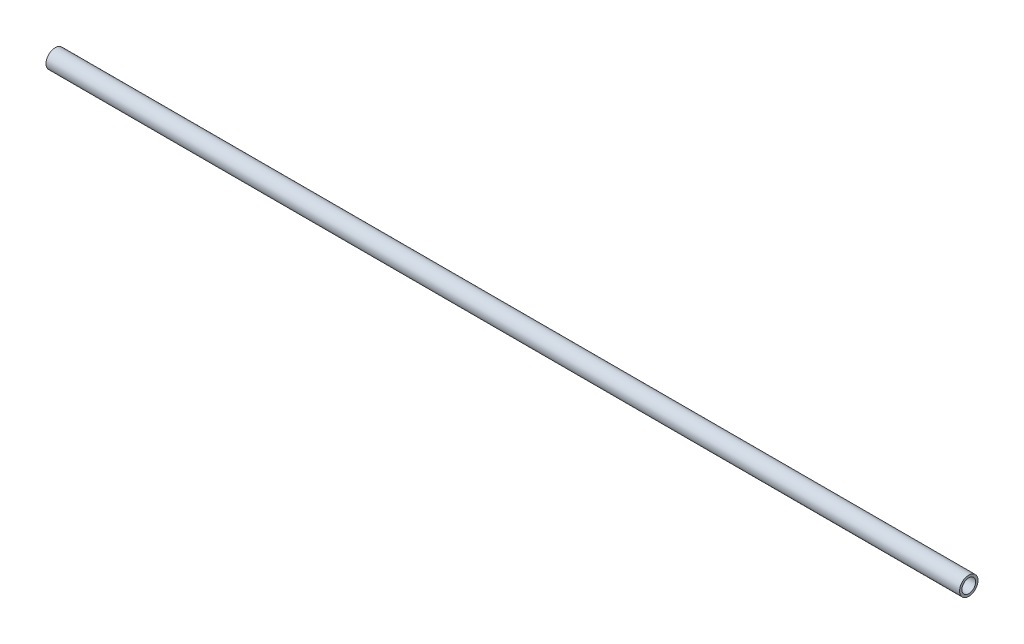
ISO-10303-21;
HEADER;
FILE_DESCRIPTION(('STEP AP214'),'2;1');
FILE_NAME('part.step','',(''),(''),'','','');
FILE_SCHEMA(('AUTOMOTIVE_DESIGN { 1 0 10303 214 1 1 1 1 }'));
ENDSEC;
DATA;
#1=APPLICATION_CONTEXT('core data for automotive mechanical design processes');
#2=APPLICATION_PROTOCOL_DEFINITION('international standard','automotive_design',2000,#1);
#3=PRODUCT_CONTEXT('',#1,'mechanical');
#4=PRODUCT('Part','Part','',(#3));
#5=PRODUCT_RELATED_PRODUCT_CATEGORY('part','',(#4));
#6=PRODUCT_DEFINITION_FORMATION('','',#4);
#7=PRODUCT_DEFINITION_CONTEXT('part definition',#1,'design');
#8=PRODUCT_DEFINITION('design','',#6,#7);
#9=PRODUCT_DEFINITION_SHAPE('','',#8);
#10=(LENGTH_UNIT() NAMED_UNIT(*) SI_UNIT(.MILLI.,.METRE.));
#11=(NAMED_UNIT(*) PLANE_ANGLE_UNIT() SI_UNIT($,.RADIAN.));
#12=(NAMED_UNIT(*) SI_UNIT($,.STERADIAN.) SOLID_ANGLE_UNIT());
#13=UNCERTAINTY_MEASURE_WITH_UNIT(LENGTH_MEASURE(1.E-05),#10,'distance_accuracy_value','');
#14=(GEOMETRIC_REPRESENTATION_CONTEXT(3) GLOBAL_UNCERTAINTY_ASSIGNED_CONTEXT((#13)) GLOBAL_UNIT_ASSIGNED_CONTEXT((#10,
#11,#12)) REPRESENTATION_CONTEXT('',''));
#15=CARTESIAN_POINT('',(0.,0.,0.));
#16=DIRECTION('',(0.,0.,1.));
#17=DIRECTION('',(1.,0.,0.));
#18=AXIS2_PLACEMENT_3D('',#15,#16,#17);
#19=CARTESIAN_POINT('',(635.,0.,0.));
#20=DIRECTION('',(1.,0.,0.));
#21=DIRECTION('',(0.,0.,-1.));
#22=AXIS2_PLACEMENT_3D('',#19,#20,#21);
#23=PLANE('',#22);
#24=CARTESIAN_POINT('',(635.,0.,0.));
#25=DIRECTION('',(1.,0.,0.));
#26=DIRECTION('',(0.,0.,-1.));
#27=AXIS2_PLACEMENT_3D('',#24,#25,#26);
#28=CIRCLE('',#27,6.4135);
#29=CARTESIAN_POINT('',(635.,0.,-6.4135));
#30=VERTEX_POINT('',#29);
#31=EDGE_CURVE('E10',#30,#30,#28,.T.);
#32=ORIENTED_EDGE('',*,*,#31,.T.);
#33=EDGE_LOOP('',(#32));
#34=FACE_BOUND('',#33,.T.);
#35=CARTESIAN_POINT('',(635.,0.,0.));
#36=DIRECTION('',(1.,0.,0.));
#37=DIRECTION('',(0.,0.,-1.));
#38=AXIS2_PLACEMENT_3D('',#35,#36,#37);
#39=CIRCLE('',#38,4.7625);
#40=CARTESIAN_POINT('',(635.,0.,-4.7625));
#41=VERTEX_POINT('',#40);
#42=EDGE_CURVE('E50',#41,#41,#39,.T.);
#43=ORIENTED_EDGE('',*,*,#42,.F.);
#44=EDGE_LOOP('',(#43));
#45=FACE_BOUND('',#44,.T.);
#46=ADVANCED_FACE('F37',(#34,#45),#23,.T.);
#47=CARTESIAN_POINT('',(0.,0.,0.));
#48=DIRECTION('',(1.,0.,0.));
#49=DIRECTION('',(0.,0.,-1.));
#50=AXIS2_PLACEMENT_3D('',#47,#48,#49);
#51=PLANE('',#50);
#52=CARTESIAN_POINT('',(0.,0.,0.));
#53=DIRECTION('',(1.,0.,0.));
#54=DIRECTION('',(0.,0.,-1.));
#55=AXIS2_PLACEMENT_3D('',#52,#53,#54);
#56=CIRCLE('',#55,6.4135);
#57=CARTESIAN_POINT('',(0.,0.,-6.4135));
#58=VERTEX_POINT('',#57);
#59=EDGE_CURVE('E41',#58,#58,#56,.T.);
#60=ORIENTED_EDGE('',*,*,#59,.F.);
#61=EDGE_LOOP('',(#60));
#62=FACE_BOUND('',#61,.T.);
#63=CARTESIAN_POINT('',(0.,0.,0.));
#64=DIRECTION('',(1.,0.,0.));
#65=DIRECTION('',(0.,0.,-1.));
#66=AXIS2_PLACEMENT_3D('',#63,#64,#65);
#67=CIRCLE('',#66,4.7625);
#68=CARTESIAN_POINT('',(0.,0.,-4.7625));
#69=VERTEX_POINT('',#68);
#70=EDGE_CURVE('E52',#69,#69,#67,.T.);
#71=ORIENTED_EDGE('',*,*,#70,.T.);
#72=EDGE_LOOP('',(#71));
#73=FACE_BOUND('',#72,.T.);
#74=ADVANCED_FACE('F64',(#62,#73),#51,.F.);
#75=CARTESIAN_POINT('',(635.,0.,0.));
#76=DIRECTION('',(-1.,0.,0.));
#77=DIRECTION('',(0.,0.,1.));
#78=AXIS2_PLACEMENT_3D('',#75,#76,#77);
#79=CYLINDRICAL_SURFACE('',#78,6.4135);
#80=ORIENTED_EDGE('',*,*,#31,.F.);
#81=EDGE_LOOP('',(#80));
#82=FACE_BOUND('',#81,.T.);
#83=ORIENTED_EDGE('',*,*,#59,.T.);
#84=EDGE_LOOP('',(#83));
#85=FACE_BOUND('',#84,.T.);
#86=ADVANCED_FACE('F39',(#82,#85),#79,.T.);
#87=CARTESIAN_POINT('',(635.,0.,0.));
#88=DIRECTION('',(-1.,0.,0.));
#89=DIRECTION('',(0.,0.,1.));
#90=AXIS2_PLACEMENT_3D('',#87,#88,#89);
#91=CYLINDRICAL_SURFACE('',#90,4.7625);
#92=ORIENTED_EDGE('',*,*,#42,.T.);
#93=EDGE_LOOP('',(#92));
#94=FACE_BOUND('',#93,.T.);
#95=ORIENTED_EDGE('',*,*,#70,.F.);
#96=EDGE_LOOP('',(#95));
#97=FACE_BOUND('',#96,.T.);
#98=ADVANCED_FACE('F60',(#94,#97),#91,.F.);
#99=CLOSED_SHELL('',(#46,#74,#86,#98));
#100=MANIFOLD_SOLID_BREP('B2',#99);
#101=ADVANCED_BREP_SHAPE_REPRESENTATION('',(#18,#100),#14);
#102=SHAPE_DEFINITION_REPRESENTATION(#9,#101);
ENDSEC;
END-ISO-10303-21;
